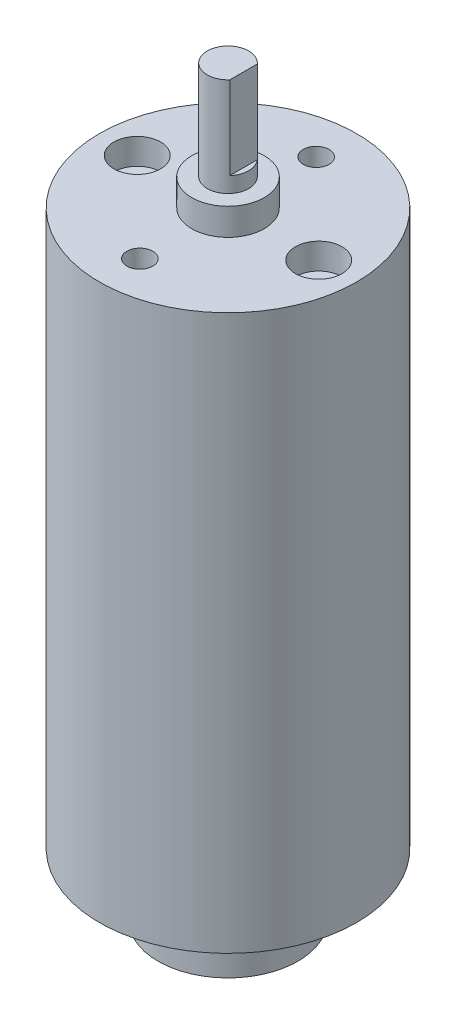
ISO-10303-21;
HEADER;
FILE_DESCRIPTION(('STEP AP214'),'2;1');
FILE_NAME('part.step','',(''),(''),'','','');
FILE_SCHEMA(('AUTOMOTIVE_DESIGN { 1 0 10303 214 1 1 1 1 }'));
ENDSEC;
DATA;
#1=APPLICATION_CONTEXT('core data for automotive mechanical design processes');
#2=APPLICATION_PROTOCOL_DEFINITION('international standard','automotive_design',2000,#1);
#3=PRODUCT_CONTEXT('',#1,'mechanical');
#4=PRODUCT('Part','Part','',(#3));
#5=PRODUCT_RELATED_PRODUCT_CATEGORY('part','',(#4));
#6=PRODUCT_DEFINITION_FORMATION('','',#4);
#7=PRODUCT_DEFINITION_CONTEXT('part definition',#1,'design');
#8=PRODUCT_DEFINITION('design','',#6,#7);
#9=PRODUCT_DEFINITION_SHAPE('','',#8);
#10=(LENGTH_UNIT() NAMED_UNIT(*) SI_UNIT(.MILLI.,.METRE.));
#11=(NAMED_UNIT(*) PLANE_ANGLE_UNIT() SI_UNIT($,.RADIAN.));
#12=(NAMED_UNIT(*) SI_UNIT($,.STERADIAN.) SOLID_ANGLE_UNIT());
#13=UNCERTAINTY_MEASURE_WITH_UNIT(LENGTH_MEASURE(1.E-05),#10,'distance_accuracy_value','');
#14=(GEOMETRIC_REPRESENTATION_CONTEXT(3) GLOBAL_UNCERTAINTY_ASSIGNED_CONTEXT((#13)) GLOBAL_UNIT_ASSIGNED_CONTEXT((#10,
#11,#12)) REPRESENTATION_CONTEXT('',''));
#15=CARTESIAN_POINT('',(0.,0.,0.));
#16=DIRECTION('',(0.,0.,1.));
#17=DIRECTION('',(1.,0.,0.));
#18=AXIS2_PLACEMENT_3D('',#15,#16,#17);
#19=CARTESIAN_POINT('',(0.,0.,0.));
#20=DIRECTION('',(0.,1.,0.));
#21=DIRECTION('',(-1.,0.,0.));
#22=AXIS2_PLACEMENT_3D('',#19,#20,#21);
#23=PLANE('',#22);
#24=CARTESIAN_POINT('',(0.,0.,0.));
#25=DIRECTION('',(0.,-1.,0.));
#26=DIRECTION('',(-1.,0.,0.));
#27=AXIS2_PLACEMENT_3D('',#24,#25,#26);
#28=CIRCLE('',#27,1.);
#29=CARTESIAN_POINT('',(-1.,0.,0.));
#30=VERTEX_POINT('',#29);
#31=EDGE_CURVE('E11',#30,#30,#28,.T.);
#32=ORIENTED_EDGE('',*,*,#31,.T.);
#33=EDGE_LOOP('',(#32));
#34=FACE_BOUND('',#33,.T.);
#35=ADVANCED_FACE('F41',(#34),#23,.F.);
#36=CARTESIAN_POINT('',(0.,73.7,0.));
#37=DIRECTION('',(0.,1.,0.));
#38=DIRECTION('',(-1.,0.,0.));
#39=AXIS2_PLACEMENT_3D('',#36,#37,#38);
#40=CYLINDRICAL_SURFACE('',#39,1.);
#41=CARTESIAN_POINT('',(0.,2.05,0.));
#42=DIRECTION('',(0.,-1.,0.));
#43=DIRECTION('',(-1.,0.,0.));
#44=AXIS2_PLACEMENT_3D('',#41,#42,#43);
#45=CIRCLE('',#44,1.);
#46=CARTESIAN_POINT('',(-1.,2.05,0.));
#47=VERTEX_POINT('',#46);
#48=EDGE_CURVE('E48',#47,#47,#45,.T.);
#49=ORIENTED_EDGE('',*,*,#48,.T.);
#50=EDGE_LOOP('',(#49));
#51=FACE_BOUND('',#50,.T.);
#52=ORIENTED_EDGE('',*,*,#31,.F.);
#53=EDGE_LOOP('',(#52));
#54=FACE_BOUND('',#53,.T.);
#55=ADVANCED_FACE('F119',(#51,#54),#40,.T.);
#56=CARTESIAN_POINT('',(1.,2.05,0.));
#57=DIRECTION('',(0.,1.,0.));
#58=DIRECTION('',(-1.,0.,0.));
#59=AXIS2_PLACEMENT_3D('',#56,#57,#58);
#60=PLANE('',#59);
#61=CARTESIAN_POINT('',(0.,2.05,0.));
#62=DIRECTION('',(0.,-1.,0.));
#63=DIRECTION('',(-1.,0.,0.));
#64=AXIS2_PLACEMENT_3D('',#61,#62,#63);
#65=CIRCLE('',#64,6.75);
#66=CARTESIAN_POINT('',(-6.75,2.05,0.));
#67=VERTEX_POINT('',#66);
#68=EDGE_CURVE('E114',#67,#67,#65,.T.);
#69=ORIENTED_EDGE('',*,*,#68,.T.);
#70=EDGE_LOOP('',(#69));
#71=FACE_BOUND('',#70,.T.);
#72=ORIENTED_EDGE('',*,*,#48,.F.);
#73=EDGE_LOOP('',(#72));
#74=FACE_BOUND('',#73,.T.);
#75=ADVANCED_FACE('F122',(#71,#74),#60,.F.);
#76=CARTESIAN_POINT('',(0.,73.7,0.));
#77=DIRECTION('',(0.,1.,0.));
#78=DIRECTION('',(-1.,0.,0.));
#79=AXIS2_PLACEMENT_3D('',#76,#77,#78);
#80=CYLINDRICAL_SURFACE('',#79,6.75);
#81=CARTESIAN_POINT('',(0.,6.05,0.));
#82=DIRECTION('',(0.,-1.,0.));
#83=DIRECTION('',(-1.,0.,0.));
#84=AXIS2_PLACEMENT_3D('',#81,#82,#83);
#85=CIRCLE('',#84,6.75);
#86=CARTESIAN_POINT('',(-6.75,6.05,0.));
#87=VERTEX_POINT('',#86);
#88=EDGE_CURVE('E111',#87,#87,#85,.T.);
#89=ORIENTED_EDGE('',*,*,#88,.T.);
#90=EDGE_LOOP('',(#89));
#91=FACE_BOUND('',#90,.T.);
#92=ORIENTED_EDGE('',*,*,#68,.F.);
#93=EDGE_LOOP('',(#92));
#94=FACE_BOUND('',#93,.T.);
#95=ADVANCED_FACE('F124',(#91,#94),#80,.T.);
#96=CARTESIAN_POINT('',(6.75,6.05,0.));
#97=DIRECTION('',(0.,-1.,0.));
#98=DIRECTION('',(1.,0.,0.));
#99=AXIS2_PLACEMENT_3D('',#96,#97,#98);
#100=PLANE('',#99);
#101=CARTESIAN_POINT('',(0.,6.05,0.));
#102=DIRECTION('',(0.,-1.,0.));
#103=DIRECTION('',(-1.,0.,0.));
#104=AXIS2_PLACEMENT_3D('',#101,#102,#103);
#105=CIRCLE('',#104,1.);
#106=CARTESIAN_POINT('',(-1.,6.05,0.));
#107=VERTEX_POINT('',#106);
#108=EDGE_CURVE('E108',#107,#107,#105,.T.);
#109=ORIENTED_EDGE('',*,*,#108,.T.);
#110=EDGE_LOOP('',(#109));
#111=FACE_BOUND('',#110,.T.);
#112=ORIENTED_EDGE('',*,*,#88,.F.);
#113=EDGE_LOOP('',(#112));
#114=FACE_BOUND('',#113,.T.);
#115=ADVANCED_FACE('F131',(#111,#114),#100,.F.);
#116=CARTESIAN_POINT('',(0.,73.7,0.));
#117=DIRECTION('',(0.,1.,0.));
#118=DIRECTION('',(-1.,0.,0.));
#119=AXIS2_PLACEMENT_3D('',#116,#117,#118);
#120=CYLINDRICAL_SURFACE('',#119,1.);
#121=CARTESIAN_POINT('',(0.,8.1,0.));
#122=DIRECTION('',(0.,-1.,0.));
#123=DIRECTION('',(-1.,0.,0.));
#124=AXIS2_PLACEMENT_3D('',#121,#122,#123);
#125=CIRCLE('',#124,1.);
#126=CARTESIAN_POINT('',(-1.,8.1,0.));
#127=VERTEX_POINT('',#126);
#128=EDGE_CURVE('E105',#127,#127,#125,.T.);
#129=ORIENTED_EDGE('',*,*,#128,.T.);
#130=EDGE_LOOP('',(#129));
#131=FACE_BOUND('',#130,.T.);
#132=ORIENTED_EDGE('',*,*,#108,.F.);
#133=EDGE_LOOP('',(#132));
#134=FACE_BOUND('',#133,.T.);
#135=ADVANCED_FACE('F165',(#131,#134),#120,.T.);
#136=CARTESIAN_POINT('',(1.,8.1,0.));
#137=DIRECTION('',(0.,1.,0.));
#138=DIRECTION('',(-1.,0.,0.));
#139=AXIS2_PLACEMENT_3D('',#136,#137,#138);
#140=PLANE('',#139);
#141=CARTESIAN_POINT('',(0.,8.1,0.));
#142=DIRECTION('',(0.,-1.,0.));
#143=DIRECTION('',(-1.,0.,0.));
#144=AXIS2_PLACEMENT_3D('',#141,#142,#143);
#145=CIRCLE('',#144,12.4);
#146=CARTESIAN_POINT('',(-12.4,8.09999999999999,0.));
#147=VERTEX_POINT('',#146);
#148=EDGE_CURVE('E102',#147,#147,#145,.T.);
#149=ORIENTED_EDGE('',*,*,#148,.T.);
#150=EDGE_LOOP('',(#149));
#151=FACE_BOUND('',#150,.T.);
#152=ORIENTED_EDGE('',*,*,#128,.F.);
#153=EDGE_LOOP('',(#152));
#154=FACE_BOUND('',#153,.T.);
#155=ADVANCED_FACE('F176',(#151,#154),#140,.F.);
#156=CARTESIAN_POINT('',(0.,73.7,0.));
#157=DIRECTION('',(0.,1.,0.));
#158=DIRECTION('',(-1.,0.,0.));
#159=AXIS2_PLACEMENT_3D('',#156,#157,#158);
#160=CYLINDRICAL_SURFACE('',#159,12.4);
#161=CARTESIAN_POINT('',(0.,61.6,0.));
#162=DIRECTION('',(0.,-1.,0.));
#163=DIRECTION('',(-1.,0.,0.));
#164=AXIS2_PLACEMENT_3D('',#161,#162,#163);
#165=CIRCLE('',#164,12.4);
#166=CARTESIAN_POINT('',(-12.4,61.6,0.));
#167=VERTEX_POINT('',#166);
#168=EDGE_CURVE('E99',#167,#167,#165,.T.);
#169=ORIENTED_EDGE('',*,*,#168,.T.);
#170=EDGE_LOOP('',(#169));
#171=FACE_BOUND('',#170,.T.);
#172=ORIENTED_EDGE('',*,*,#148,.F.);
#173=EDGE_LOOP('',(#172));
#174=FACE_BOUND('',#173,.T.);
#175=ADVANCED_FACE('F187',(#171,#174),#160,.T.);
#176=CARTESIAN_POINT('',(12.4,61.6,0.));
#177=DIRECTION('',(0.,-1.,0.));
#178=DIRECTION('',(1.,0.,0.));
#179=AXIS2_PLACEMENT_3D('',#176,#177,#178);
#180=PLANE('',#179);
#181=CARTESIAN_POINT('',(8.75,61.6,0.));
#182=DIRECTION('',(0.,-1.,0.));
#183=DIRECTION('',(-1.,0.,0.));
#184=AXIS2_PLACEMENT_3D('',#181,#182,#183);
#185=CIRCLE('',#184,2.25);
#186=CARTESIAN_POINT('',(6.5,61.6,0.));
#187=VERTEX_POINT('',#186);
#188=EDGE_CURVE('E89',#187,#187,#185,.T.);
#189=ORIENTED_EDGE('',*,*,#188,.T.);
#190=EDGE_LOOP('',(#189));
#191=FACE_BOUND('',#190,.T.);
#192=CARTESIAN_POINT('',(-8.75000000000001,61.6,0.));
#193=DIRECTION('',(0.,-1.,0.));
#194=DIRECTION('',(-1.,0.,0.));
#195=AXIS2_PLACEMENT_3D('',#192,#193,#194);
#196=CIRCLE('',#195,2.25);
#197=CARTESIAN_POINT('',(-11.,61.6,0.));
#198=VERTEX_POINT('',#197);
#199=EDGE_CURVE('E394',#198,#198,#196,.T.);
#200=ORIENTED_EDGE('',*,*,#199,.T.);
#201=EDGE_LOOP('',(#200));
#202=FACE_BOUND('',#201,.T.);
#203=CARTESIAN_POINT('',(0.,61.6,-8.5));
#204=DIRECTION('',(0.,-1.,0.));
#205=DIRECTION('',(-1.,0.,0.));
#206=AXIS2_PLACEMENT_3D('',#203,#204,#205);
#207=CIRCLE('',#206,1.25);
#208=CARTESIAN_POINT('',(-1.25000000000007,61.6,-8.5));
#209=VERTEX_POINT('',#208);
#210=EDGE_CURVE('E400',#209,#209,#207,.T.);
#211=ORIENTED_EDGE('',*,*,#210,.T.);
#212=EDGE_LOOP('',(#211));
#213=FACE_BOUND('',#212,.T.);
#214=CARTESIAN_POINT('',(0.,61.6,8.5));
#215=DIRECTION('',(0.,-1.,0.));
#216=DIRECTION('',(-1.,0.,0.));
#217=AXIS2_PLACEMENT_3D('',#214,#215,#216);
#218=CIRCLE('',#217,1.25);
#219=CARTESIAN_POINT('',(-1.25000000000001,61.6,8.5));
#220=VERTEX_POINT('',#219);
#221=EDGE_CURVE('E405',#220,#220,#218,.T.);
#222=ORIENTED_EDGE('',*,*,#221,.T.);
#223=EDGE_LOOP('',(#222));
#224=FACE_BOUND('',#223,.T.);
#225=CARTESIAN_POINT('',(0.,61.6,0.));
#226=DIRECTION('',(0.,-1.,0.));
#227=DIRECTION('',(-1.,0.,0.));
#228=AXIS2_PLACEMENT_3D('',#225,#226,#227);
#229=CIRCLE('',#228,3.5);
#230=CARTESIAN_POINT('',(-3.50000000000001,61.6,0.));
#231=VERTEX_POINT('',#230);
#232=EDGE_CURVE('E96',#231,#231,#229,.T.);
#233=ORIENTED_EDGE('',*,*,#232,.T.);
#234=EDGE_LOOP('',(#233));
#235=FACE_BOUND('',#234,.T.);
#236=ORIENTED_EDGE('',*,*,#168,.F.);
#237=EDGE_LOOP('',(#236));
#238=FACE_BOUND('',#237,.T.);
#239=ADVANCED_FACE('F198',(#191,#202,#213,#224,#235,#238),#180,.F.);
#240=CARTESIAN_POINT('',(0.,73.7,0.));
#241=DIRECTION('',(0.,1.,0.));
#242=DIRECTION('',(-1.,0.,0.));
#243=AXIS2_PLACEMENT_3D('',#240,#241,#242);
#244=CYLINDRICAL_SURFACE('',#243,3.5);
#245=CARTESIAN_POINT('',(0.,64.2,0.));
#246=DIRECTION('',(0.,-1.,0.));
#247=DIRECTION('',(-1.,0.,0.));
#248=AXIS2_PLACEMENT_3D('',#245,#246,#247);
#249=CIRCLE('',#248,3.5);
#250=CARTESIAN_POINT('',(-3.50000000000001,64.2,0.));
#251=VERTEX_POINT('',#250);
#252=EDGE_CURVE('E86',#251,#251,#249,.T.);
#253=ORIENTED_EDGE('',*,*,#252,.T.);
#254=EDGE_LOOP('',(#253));
#255=FACE_BOUND('',#254,.T.);
#256=ORIENTED_EDGE('',*,*,#232,.F.);
#257=EDGE_LOOP('',(#256));
#258=FACE_BOUND('',#257,.T.);
#259=ADVANCED_FACE('F209',(#255,#258),#244,.T.);
#260=CARTESIAN_POINT('',(3.49999999999999,64.2,0.));
#261=DIRECTION('',(0.,-1.,0.));
#262=DIRECTION('',(1.,0.,0.));
#263=AXIS2_PLACEMENT_3D('',#260,#261,#262);
#264=PLANE('',#263);
#265=CARTESIAN_POINT('',(0.,64.2,0.));
#266=DIRECTION('',(0.,-1.,0.));
#267=DIRECTION('',(-1.,0.,0.));
#268=AXIS2_PLACEMENT_3D('',#265,#266,#267);
#269=CIRCLE('',#268,2.);
#270=CARTESIAN_POINT('',(-2.00000000000001,64.2,0.));
#271=VERTEX_POINT('',#270);
#272=EDGE_CURVE('E82',#271,#271,#269,.T.);
#273=ORIENTED_EDGE('',*,*,#272,.T.);
#274=EDGE_LOOP('',(#273));
#275=FACE_BOUND('',#274,.T.);
#276=ORIENTED_EDGE('',*,*,#252,.F.);
#277=EDGE_LOOP('',(#276));
#278=FACE_BOUND('',#277,.T.);
#279=ADVANCED_FACE('F220',(#275,#278),#264,.F.);
#280=CARTESIAN_POINT('',(0.,73.7,0.));
#281=DIRECTION('',(0.,1.,0.));
#282=DIRECTION('',(-1.,0.,0.));
#283=AXIS2_PLACEMENT_3D('',#280,#281,#282);
#284=CYLINDRICAL_SURFACE('',#283,2.);
#285=CARTESIAN_POINT('',(0.,65.7,0.));
#286=DIRECTION('',(0.,-1.,0.));
#287=DIRECTION('',(0.,0.,-1.));
#288=AXIS2_PLACEMENT_3D('',#285,#286,#287);
#289=CIRCLE('',#288,2.);
#290=CARTESIAN_POINT('',(1.49999999999999,65.7,-1.32287565553229));
#291=VERTEX_POINT('',#290);
#292=CARTESIAN_POINT('',(1.49999999999999,65.7,1.3228756555323));
#293=VERTEX_POINT('',#292);
#294=EDGE_CURVE('E70',#291,#293,#289,.T.);
#295=ORIENTED_EDGE('',*,*,#294,.T.);
#296=DIRECTION('',(0.,1.,0.));
#297=VECTOR('',#296,1.);
#298=CARTESIAN_POINT('',(1.49999999999999,65.7,1.3228756555323));
#299=LINE('',#298,#297);
#300=CARTESIAN_POINT('',(1.49999999999999,73.7,1.3228756555323));
#301=VERTEX_POINT('',#300);
#302=EDGE_CURVE('E78',#293,#301,#299,.T.);
#303=ORIENTED_EDGE('',*,*,#302,.T.);
#304=CARTESIAN_POINT('',(0.,73.7,0.));
#305=DIRECTION('',(0.,-1.,0.));
#306=DIRECTION('',(-1.,0.,0.));
#307=AXIS2_PLACEMENT_3D('',#304,#305,#306);
#308=CIRCLE('',#307,2.);
#309=CARTESIAN_POINT('',(1.49999999999999,73.7,-1.32287565553229));
#310=VERTEX_POINT('',#309);
#311=EDGE_CURVE('E68',#301,#310,#308,.T.);
#312=ORIENTED_EDGE('',*,*,#311,.T.);
#313=DIRECTION('',(0.,1.,0.));
#314=VECTOR('',#313,1.);
#315=CARTESIAN_POINT('',(1.49999999999999,65.7,-1.32287565553229));
#316=LINE('',#315,#314);
#317=EDGE_CURVE('E72',#291,#310,#316,.T.);
#318=ORIENTED_EDGE('',*,*,#317,.F.);
#319=EDGE_LOOP('',(#295,#303,#312,#318));
#320=FACE_BOUND('',#319,.T.);
#321=ORIENTED_EDGE('',*,*,#272,.F.);
#322=EDGE_LOOP('',(#321));
#323=FACE_BOUND('',#322,.T.);
#324=ADVANCED_FACE('F80',(#320,#323),#284,.T.);
#325=CARTESIAN_POINT('',(1.99999999999999,73.7,0.));
#326=DIRECTION('',(0.,-1.,0.));
#327=DIRECTION('',(1.,0.,0.));
#328=AXIS2_PLACEMENT_3D('',#325,#326,#327);
#329=PLANE('',#328);
#330=ORIENTED_EDGE('',*,*,#311,.F.);
#331=DIRECTION('',(0.,0.,-1.));
#332=VECTOR('',#331,1.);
#333=CARTESIAN_POINT('',(1.49999999999999,73.7,0.));
#334=LINE('',#333,#332);
#335=EDGE_CURVE('E55',#301,#310,#334,.T.);
#336=ORIENTED_EDGE('',*,*,#335,.T.);
#337=EDGE_LOOP('',(#330,#336));
#338=FACE_BOUND('',#337,.T.);
#339=ADVANCED_FACE('F66',(#338),#329,.F.);
#340=CARTESIAN_POINT('',(0.,59.1,8.5));
#341=DIRECTION('',(0.,1.,0.));
#342=DIRECTION('',(-1.,0.,0.));
#343=AXIS2_PLACEMENT_3D('',#340,#341,#342);
#344=CYLINDRICAL_SURFACE('',#343,1.25);
#345=CARTESIAN_POINT('',(0.,59.1,8.5));
#346=DIRECTION('',(0.,-1.,0.));
#347=DIRECTION('',(-1.,0.,0.));
#348=AXIS2_PLACEMENT_3D('',#345,#346,#347);
#349=CIRCLE('',#348,1.25);
#350=CARTESIAN_POINT('',(-1.25000000000001,59.1,8.5));
#351=VERTEX_POINT('',#350);
#352=EDGE_CURVE('E77',#351,#351,#349,.T.);
#353=ORIENTED_EDGE('',*,*,#352,.T.);
#354=EDGE_LOOP('',(#353));
#355=FACE_BOUND('',#354,.T.);
#356=ORIENTED_EDGE('',*,*,#221,.F.);
#357=EDGE_LOOP('',(#356));
#358=FACE_BOUND('',#357,.T.);
#359=ADVANCED_FACE('F250',(#355,#358),#344,.F.);
#360=CARTESIAN_POINT('',(0.,59.1,8.5));
#361=DIRECTION('',(0.,1.,0.));
#362=DIRECTION('',(-1.,0.,0.));
#363=AXIS2_PLACEMENT_3D('',#360,#361,#362);
#364=PLANE('',#363);
#365=ORIENTED_EDGE('',*,*,#352,.F.);
#366=EDGE_LOOP('',(#365));
#367=FACE_BOUND('',#366,.T.);
#368=ADVANCED_FACE('F260',(#367),#364,.T.);
#369=CARTESIAN_POINT('',(0.,59.1,-8.5));
#370=DIRECTION('',(0.,1.,0.));
#371=DIRECTION('',(-1.,0.,0.));
#372=AXIS2_PLACEMENT_3D('',#369,#370,#371);
#373=CYLINDRICAL_SURFACE('',#372,1.25);
#374=CARTESIAN_POINT('',(0.,59.1,-8.5));
#375=DIRECTION('',(0.,-1.,0.));
#376=DIRECTION('',(-1.,0.,0.));
#377=AXIS2_PLACEMENT_3D('',#374,#375,#376);
#378=CIRCLE('',#377,1.25);
#379=CARTESIAN_POINT('',(-1.25000000000007,59.1,-8.5));
#380=VERTEX_POINT('',#379);
#381=EDGE_CURVE('E403',#380,#380,#378,.T.);
#382=ORIENTED_EDGE('',*,*,#381,.T.);
#383=EDGE_LOOP('',(#382));
#384=FACE_BOUND('',#383,.T.);
#385=ORIENTED_EDGE('',*,*,#210,.F.);
#386=EDGE_LOOP('',(#385));
#387=FACE_BOUND('',#386,.T.);
#388=ADVANCED_FACE('F271',(#384,#387),#373,.F.);
#389=CARTESIAN_POINT('',(0.,59.1,-8.5));
#390=DIRECTION('',(0.,1.,0.));
#391=DIRECTION('',(-1.,0.,0.));
#392=AXIS2_PLACEMENT_3D('',#389,#390,#391);
#393=PLANE('',#392);
#394=ORIENTED_EDGE('',*,*,#381,.F.);
#395=EDGE_LOOP('',(#394));
#396=FACE_BOUND('',#395,.T.);
#397=ADVANCED_FACE('F282',(#396),#393,.T.);
#398=CARTESIAN_POINT('',(-8.75000000000001,59.1,0.));
#399=DIRECTION('',(0.,1.,0.));
#400=DIRECTION('',(-1.,0.,0.));
#401=AXIS2_PLACEMENT_3D('',#398,#399,#400);
#402=CYLINDRICAL_SURFACE('',#401,2.25);
#403=CARTESIAN_POINT('',(-8.75000000000001,59.1,0.));
#404=DIRECTION('',(0.,-1.,0.));
#405=DIRECTION('',(-1.,0.,0.));
#406=AXIS2_PLACEMENT_3D('',#403,#404,#405);
#407=CIRCLE('',#406,2.25);
#408=CARTESIAN_POINT('',(-11.,59.1,0.));
#409=VERTEX_POINT('',#408);
#410=EDGE_CURVE('E397',#409,#409,#407,.T.);
#411=ORIENTED_EDGE('',*,*,#410,.T.);
#412=EDGE_LOOP('',(#411));
#413=FACE_BOUND('',#412,.T.);
#414=ORIENTED_EDGE('',*,*,#199,.F.);
#415=EDGE_LOOP('',(#414));
#416=FACE_BOUND('',#415,.T.);
#417=ADVANCED_FACE('F293',(#413,#416),#402,.F.);
#418=CARTESIAN_POINT('',(-8.75000000000001,59.1,0.));
#419=DIRECTION('',(0.,1.,0.));
#420=DIRECTION('',(-1.,0.,0.));
#421=AXIS2_PLACEMENT_3D('',#418,#419,#420);
#422=PLANE('',#421);
#423=ORIENTED_EDGE('',*,*,#410,.F.);
#424=EDGE_LOOP('',(#423));
#425=FACE_BOUND('',#424,.T.);
#426=ADVANCED_FACE('F304',(#425),#422,.T.);
#427=CARTESIAN_POINT('',(8.75,59.1,0.));
#428=DIRECTION('',(0.,1.,0.));
#429=DIRECTION('',(-1.,0.,0.));
#430=AXIS2_PLACEMENT_3D('',#427,#428,#429);
#431=CYLINDRICAL_SURFACE('',#430,2.25);
#432=CARTESIAN_POINT('',(8.75,59.1,0.));
#433=DIRECTION('',(0.,-1.,0.));
#434=DIRECTION('',(-1.,0.,0.));
#435=AXIS2_PLACEMENT_3D('',#432,#433,#434);
#436=CIRCLE('',#435,2.25);
#437=CARTESIAN_POINT('',(6.5,59.1,0.));
#438=VERTEX_POINT('',#437);
#439=EDGE_CURVE('E83',#438,#438,#436,.T.);
#440=ORIENTED_EDGE('',*,*,#439,.T.);
#441=EDGE_LOOP('',(#440));
#442=FACE_BOUND('',#441,.T.);
#443=ORIENTED_EDGE('',*,*,#188,.F.);
#444=EDGE_LOOP('',(#443));
#445=FACE_BOUND('',#444,.T.);
#446=ADVANCED_FACE('F315',(#442,#445),#431,.F.);
#447=CARTESIAN_POINT('',(8.75,59.1,0.));
#448=DIRECTION('',(0.,1.,0.));
#449=DIRECTION('',(-1.,0.,0.));
#450=AXIS2_PLACEMENT_3D('',#447,#448,#449);
#451=PLANE('',#450);
#452=ORIENTED_EDGE('',*,*,#439,.F.);
#453=EDGE_LOOP('',(#452));
#454=FACE_BOUND('',#453,.T.);
#455=ADVANCED_FACE('F326',(#454),#451,.T.);
#456=CARTESIAN_POINT('',(1.49999999999999,65.7,0.));
#457=DIRECTION('',(-1.,0.,0.));
#458=DIRECTION('',(0.,0.,-1.));
#459=AXIS2_PLACEMENT_3D('',#456,#457,#458);
#460=PLANE('',#459);
#461=ORIENTED_EDGE('',*,*,#335,.F.);
#462=ORIENTED_EDGE('',*,*,#302,.F.);
#463=DIRECTION('',(0.,0.,-1.));
#464=VECTOR('',#463,1.);
#465=CARTESIAN_POINT('',(1.49999999999999,65.7,0.));
#466=LINE('',#465,#464);
#467=EDGE_CURVE('E61',#293,#291,#466,.T.);
#468=ORIENTED_EDGE('',*,*,#467,.T.);
#469=ORIENTED_EDGE('',*,*,#317,.T.);
#470=EDGE_LOOP('',(#461,#462,#468,#469));
#471=FACE_BOUND('',#470,.T.);
#472=ADVANCED_FACE('F73',(#471),#460,.F.);
#473=CARTESIAN_POINT('',(0.,65.7,0.));
#474=DIRECTION('',(0.,1.,0.));
#475=DIRECTION('',(0.,0.,-1.));
#476=AXIS2_PLACEMENT_3D('',#473,#474,#475);
#477=PLANE('',#476);
#478=ORIENTED_EDGE('',*,*,#294,.F.);
#479=ORIENTED_EDGE('',*,*,#467,.F.);
#480=EDGE_LOOP('',(#478,#479));
#481=FACE_BOUND('',#480,.T.);
#482=ADVANCED_FACE('F347',(#481),#477,.T.);
#483=CLOSED_SHELL('',(#35,#55,#75,#95,#115,#135,#155,#175,#239,#259,#279,#324,#339,#359,#368,
#388,#397,#417,#426,#446,#455,#472,#482));
#484=MANIFOLD_SOLID_BREP('B2',#483);
#485=ADVANCED_BREP_SHAPE_REPRESENTATION('',(#18,#484),#14);
#486=SHAPE_DEFINITION_REPRESENTATION(#9,#485);
ENDSEC;
END-ISO-10303-21;
